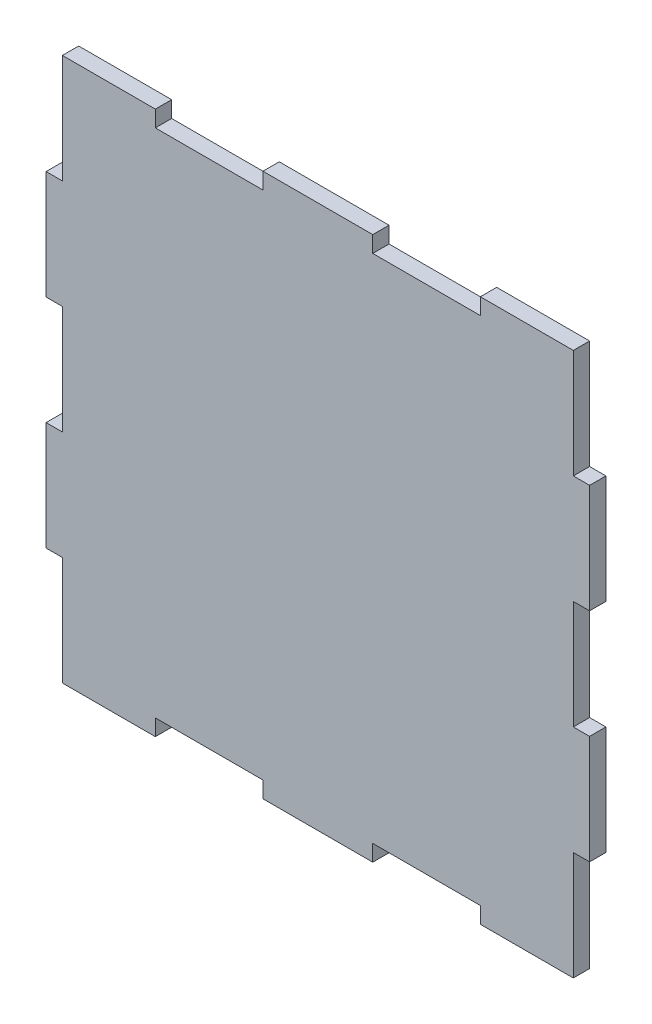
ISO-10303-21;
HEADER;
FILE_DESCRIPTION(('STEP AP214'),'2;1');
FILE_NAME('part.step','',(''),(''),'','','');
FILE_SCHEMA(('AUTOMOTIVE_DESIGN { 1 0 10303 214 1 1 1 1 }'));
ENDSEC;
DATA;
#1=APPLICATION_CONTEXT('core data for automotive mechanical design processes');
#2=APPLICATION_PROTOCOL_DEFINITION('international standard','automotive_design',2000,#1);
#3=PRODUCT_CONTEXT('',#1,'mechanical');
#4=PRODUCT('Part','Part','',(#3));
#5=PRODUCT_RELATED_PRODUCT_CATEGORY('part','',(#4));
#6=PRODUCT_DEFINITION_FORMATION('','',#4);
#7=PRODUCT_DEFINITION_CONTEXT('part definition',#1,'design');
#8=PRODUCT_DEFINITION('design','',#6,#7);
#9=PRODUCT_DEFINITION_SHAPE('','',#8);
#10=(LENGTH_UNIT() NAMED_UNIT(*) SI_UNIT(.MILLI.,.METRE.));
#11=(NAMED_UNIT(*) PLANE_ANGLE_UNIT() SI_UNIT($,.RADIAN.));
#12=(NAMED_UNIT(*) SI_UNIT($,.STERADIAN.) SOLID_ANGLE_UNIT());
#13=UNCERTAINTY_MEASURE_WITH_UNIT(LENGTH_MEASURE(1.E-05),#10,'distance_accuracy_value','');
#14=(GEOMETRIC_REPRESENTATION_CONTEXT(3) GLOBAL_UNCERTAINTY_ASSIGNED_CONTEXT((#13)) GLOBAL_UNIT_ASSIGNED_CONTEXT((#10,
#11,#12)) REPRESENTATION_CONTEXT('',''));
#15=CARTESIAN_POINT('',(0.,0.,0.));
#16=DIRECTION('',(0.,0.,1.));
#17=DIRECTION('',(1.,0.,0.));
#18=AXIS2_PLACEMENT_3D('',#15,#16,#17);
#19=CARTESIAN_POINT('',(97.0000000000007,6.73072708678998E-13,3.));
#20=DIRECTION('',(1.,0.,0.));
#21=DIRECTION('',(0.,1.,0.));
#22=AXIS2_PLACEMENT_3D('',#19,#20,#21);
#23=PLANE('',#22);
#24=DIRECTION('',(0.,-1.,0.));
#25=VECTOR('',#24,1.);
#26=CARTESIAN_POINT('',(97.0000000000007,6.73072708678998E-13,0.));
#27=LINE('',#26,#25);
#28=CARTESIAN_POINT('',(97.,100.,0.));
#29=VERTEX_POINT('',#28);
#30=CARTESIAN_POINT('',(97.0000000000001,80.0000000000002,0.));
#31=VERTEX_POINT('',#30);
#32=EDGE_CURVE('E469',#29,#31,#27,.T.);
#33=ORIENTED_EDGE('',*,*,#32,.F.);
#34=DIRECTION('',(0.,0.,-1.));
#35=VECTOR('',#34,1.);
#36=CARTESIAN_POINT('',(97.,100.,3.));
#37=LINE('',#36,#35);
#38=CARTESIAN_POINT('',(97.,100.,3.));
#39=VERTEX_POINT('',#38);
#40=EDGE_CURVE('E11',#39,#29,#37,.T.);
#41=ORIENTED_EDGE('',*,*,#40,.F.);
#42=DIRECTION('',(0.,-1.,0.));
#43=VECTOR('',#42,1.);
#44=CARTESIAN_POINT('',(97.0000000000007,6.73072708678998E-13,3.));
#45=LINE('',#44,#43);
#46=CARTESIAN_POINT('',(97.0000000000001,80.0000000000002,3.));
#47=VERTEX_POINT('',#46);
#48=EDGE_CURVE('E369',#39,#47,#45,.T.);
#49=ORIENTED_EDGE('',*,*,#48,.T.);
#50=DIRECTION('',(0.,0.,-1.));
#51=VECTOR('',#50,1.);
#52=CARTESIAN_POINT('',(97.0000000000001,80.0000000000002,3.));
#53=LINE('',#52,#51);
#54=EDGE_CURVE('E52',#47,#31,#53,.T.);
#55=ORIENTED_EDGE('',*,*,#54,.T.);
#56=EDGE_LOOP('',(#33,#41,#49,#55));
#57=FACE_BOUND('',#56,.T.);
#58=ADVANCED_FACE('F36',(#57),#23,.T.);
#59=CARTESIAN_POINT('',(0.,100.,3.));
#60=DIRECTION('',(0.,1.,0.));
#61=DIRECTION('',(0.,0.,1.));
#62=AXIS2_PLACEMENT_3D('',#59,#60,#61);
#63=PLANE('',#62);
#64=DIRECTION('',(1.,0.,0.));
#65=VECTOR('',#64,1.);
#66=CARTESIAN_POINT('',(0.,100.,0.));
#67=LINE('',#66,#65);
#68=CARTESIAN_POINT('',(79.9,100.,0.));
#69=VERTEX_POINT('',#68);
#70=EDGE_CURVE('E463',#69,#29,#67,.T.);
#71=ORIENTED_EDGE('',*,*,#70,.F.);
#72=DIRECTION('',(0.,0.,-1.));
#73=VECTOR('',#72,1.);
#74=CARTESIAN_POINT('',(79.9,100.,3.));
#75=LINE('',#74,#73);
#76=CARTESIAN_POINT('',(79.9,100.,3.));
#77=VERTEX_POINT('',#76);
#78=EDGE_CURVE('E44',#77,#69,#75,.T.);
#79=ORIENTED_EDGE('',*,*,#78,.F.);
#80=DIRECTION('',(1.,0.,0.));
#81=VECTOR('',#80,1.);
#82=CARTESIAN_POINT('',(0.,100.,3.));
#83=LINE('',#82,#81);
#84=EDGE_CURVE('E366',#77,#39,#83,.T.);
#85=ORIENTED_EDGE('',*,*,#84,.T.);
#86=ORIENTED_EDGE('',*,*,#40,.T.);
#87=EDGE_LOOP('',(#71,#79,#85,#86));
#88=FACE_BOUND('',#87,.T.);
#89=ADVANCED_FACE('F468',(#88),#63,.T.);
#90=CARTESIAN_POINT('',(79.8999999999996,-3.69611748614788E-13,3.));
#91=DIRECTION('',(1.,0.,0.));
#92=DIRECTION('',(0.,1.,0.));
#93=AXIS2_PLACEMENT_3D('',#90,#91,#92);
#94=PLANE('',#93);
#95=DIRECTION('',(0.,-1.,0.));
#96=VECTOR('',#95,1.);
#97=CARTESIAN_POINT('',(79.8999999999996,-3.69611748614788E-13,0.));
#98=LINE('',#97,#96);
#99=CARTESIAN_POINT('',(79.9,97.,0.));
#100=VERTEX_POINT('',#99);
#101=EDGE_CURVE('E456',#69,#100,#98,.T.);
#102=ORIENTED_EDGE('',*,*,#101,.T.);
#103=DIRECTION('',(0.,0.,-1.));
#104=VECTOR('',#103,1.);
#105=CARTESIAN_POINT('',(79.9,97.,3.));
#106=LINE('',#105,#104);
#107=CARTESIAN_POINT('',(79.9,97.,3.));
#108=VERTEX_POINT('',#107);
#109=EDGE_CURVE('E449',#108,#100,#106,.T.);
#110=ORIENTED_EDGE('',*,*,#109,.F.);
#111=DIRECTION('',(0.,-1.,0.));
#112=VECTOR('',#111,1.);
#113=CARTESIAN_POINT('',(79.8999999999996,-3.69611748614788E-13,3.));
#114=LINE('',#113,#112);
#115=EDGE_CURVE('E364',#77,#108,#114,.T.);
#116=ORIENTED_EDGE('',*,*,#115,.F.);
#117=ORIENTED_EDGE('',*,*,#78,.T.);
#118=EDGE_LOOP('',(#102,#110,#116,#117));
#119=FACE_BOUND('',#118,.T.);
#120=ADVANCED_FACE('F454',(#119),#94,.F.);
#121=CARTESIAN_POINT('',(0.,97.,3.));
#122=DIRECTION('',(0.,1.,0.));
#123=DIRECTION('',(-1.,0.,0.));
#124=AXIS2_PLACEMENT_3D('',#121,#122,#123);
#125=PLANE('',#124);
#126=DIRECTION('',(1.,0.,0.));
#127=VECTOR('',#126,1.);
#128=CARTESIAN_POINT('',(0.,97.,0.));
#129=LINE('',#128,#127);
#130=CARTESIAN_POINT('',(60.1,97.,0.));
#131=VERTEX_POINT('',#130);
#132=EDGE_CURVE('E466',#131,#100,#129,.T.);
#133=ORIENTED_EDGE('',*,*,#132,.F.);
#134=DIRECTION('',(0.,0.,-1.));
#135=VECTOR('',#134,1.);
#136=CARTESIAN_POINT('',(60.1,97.,3.));
#137=LINE('',#136,#135);
#138=CARTESIAN_POINT('',(60.1,97.,3.));
#139=VERTEX_POINT('',#138);
#140=EDGE_CURVE('E447',#139,#131,#137,.T.);
#141=ORIENTED_EDGE('',*,*,#140,.F.);
#142=DIRECTION('',(1.,0.,0.));
#143=VECTOR('',#142,1.);
#144=CARTESIAN_POINT('',(0.,97.,3.));
#145=LINE('',#144,#143);
#146=EDGE_CURVE('E361',#139,#108,#145,.T.);
#147=ORIENTED_EDGE('',*,*,#146,.T.);
#148=ORIENTED_EDGE('',*,*,#109,.T.);
#149=EDGE_LOOP('',(#133,#141,#147,#148));
#150=FACE_BOUND('',#149,.T.);
#151=ADVANCED_FACE('F668',(#150),#125,.T.);
#152=CARTESIAN_POINT('',(60.1,0.,3.));
#153=DIRECTION('',(1.,0.,0.));
#154=DIRECTION('',(0.,0.,-1.));
#155=AXIS2_PLACEMENT_3D('',#152,#153,#154);
#156=PLANE('',#155);
#157=DIRECTION('',(0.,-1.,0.));
#158=VECTOR('',#157,1.);
#159=CARTESIAN_POINT('',(60.1,0.,0.));
#160=LINE('',#159,#158);
#161=CARTESIAN_POINT('',(60.1,100.,0.));
#162=VERTEX_POINT('',#161);
#163=EDGE_CURVE('E479',#162,#131,#160,.T.);
#164=ORIENTED_EDGE('',*,*,#163,.F.);
#165=DIRECTION('',(0.,0.,-1.));
#166=VECTOR('',#165,1.);
#167=CARTESIAN_POINT('',(60.1,100.,3.));
#168=LINE('',#167,#166);
#169=CARTESIAN_POINT('',(60.1,100.,3.));
#170=VERTEX_POINT('',#169);
#171=EDGE_CURVE('E445',#170,#162,#168,.T.);
#172=ORIENTED_EDGE('',*,*,#171,.F.);
#173=DIRECTION('',(0.,-1.,0.));
#174=VECTOR('',#173,1.);
#175=CARTESIAN_POINT('',(60.1,0.,3.));
#176=LINE('',#175,#174);
#177=EDGE_CURVE('E358',#170,#139,#176,.T.);
#178=ORIENTED_EDGE('',*,*,#177,.T.);
#179=ORIENTED_EDGE('',*,*,#140,.T.);
#180=EDGE_LOOP('',(#164,#172,#178,#179));
#181=FACE_BOUND('',#180,.T.);
#182=ADVANCED_FACE('F665',(#181),#156,.T.);
#183=CARTESIAN_POINT('',(39.9,100.,0.));
#184=VERTEX_POINT('',#183);
#185=EDGE_CURVE('E472',#184,#162,#67,.T.);
#186=ORIENTED_EDGE('',*,*,#185,.F.);
#187=DIRECTION('',(0.,0.,-1.));
#188=VECTOR('',#187,1.);
#189=CARTESIAN_POINT('',(39.9,100.,3.));
#190=LINE('',#189,#188);
#191=CARTESIAN_POINT('',(39.9,100.,3.));
#192=VERTEX_POINT('',#191);
#193=EDGE_CURVE('E443',#192,#184,#190,.T.);
#194=ORIENTED_EDGE('',*,*,#193,.F.);
#195=EDGE_CURVE('E357',#192,#170,#83,.T.);
#196=ORIENTED_EDGE('',*,*,#195,.T.);
#197=ORIENTED_EDGE('',*,*,#171,.T.);
#198=EDGE_LOOP('',(#186,#194,#196,#197));
#199=FACE_BOUND('',#198,.T.);
#200=ADVANCED_FACE('F662',(#199),#63,.T.);
#201=CARTESIAN_POINT('',(39.8999999999998,0.,3.));
#202=DIRECTION('',(1.,0.,0.));
#203=DIRECTION('',(0.,1.,0.));
#204=AXIS2_PLACEMENT_3D('',#201,#202,#203);
#205=PLANE('',#204);
#206=DIRECTION('',(0.,-1.,0.));
#207=VECTOR('',#206,1.);
#208=CARTESIAN_POINT('',(39.8999999999998,0.,0.));
#209=LINE('',#208,#207);
#210=CARTESIAN_POINT('',(39.9,97.,0.));
#211=VERTEX_POINT('',#210);
#212=EDGE_CURVE('E478',#184,#211,#209,.T.);
#213=ORIENTED_EDGE('',*,*,#212,.T.);
#214=DIRECTION('',(0.,0.,-1.));
#215=VECTOR('',#214,1.);
#216=CARTESIAN_POINT('',(39.9,97.,3.));
#217=LINE('',#216,#215);
#218=CARTESIAN_POINT('',(39.9,97.,3.));
#219=VERTEX_POINT('',#218);
#220=EDGE_CURVE('E441',#219,#211,#217,.T.);
#221=ORIENTED_EDGE('',*,*,#220,.F.);
#222=DIRECTION('',(0.,-1.,0.));
#223=VECTOR('',#222,1.);
#224=CARTESIAN_POINT('',(39.8999999999998,0.,3.));
#225=LINE('',#224,#223);
#226=EDGE_CURVE('E355',#192,#219,#225,.T.);
#227=ORIENTED_EDGE('',*,*,#226,.F.);
#228=ORIENTED_EDGE('',*,*,#193,.T.);
#229=EDGE_LOOP('',(#213,#221,#227,#228));
#230=FACE_BOUND('',#229,.T.);
#231=ADVANCED_FACE('F658',(#230),#205,.F.);
#232=CARTESIAN_POINT('',(0.,97.,3.));
#233=DIRECTION('',(0.,1.,0.));
#234=DIRECTION('',(-1.,0.,0.));
#235=AXIS2_PLACEMENT_3D('',#232,#233,#234);
#236=PLANE('',#235);
#237=DIRECTION('',(1.,0.,0.));
#238=VECTOR('',#237,1.);
#239=CARTESIAN_POINT('',(0.,97.,0.));
#240=LINE('',#239,#238);
#241=CARTESIAN_POINT('',(20.1,97.,0.));
#242=VERTEX_POINT('',#241);
#243=EDGE_CURVE('E483',#242,#211,#240,.T.);
#244=ORIENTED_EDGE('',*,*,#243,.F.);
#245=DIRECTION('',(0.,0.,-1.));
#246=VECTOR('',#245,1.);
#247=CARTESIAN_POINT('',(20.1,97.,3.));
#248=LINE('',#247,#246);
#249=CARTESIAN_POINT('',(20.1,97.,3.));
#250=VERTEX_POINT('',#249);
#251=EDGE_CURVE('E439',#250,#242,#248,.T.);
#252=ORIENTED_EDGE('',*,*,#251,.F.);
#253=DIRECTION('',(1.,0.,0.));
#254=VECTOR('',#253,1.);
#255=CARTESIAN_POINT('',(0.,97.,3.));
#256=LINE('',#255,#254);
#257=EDGE_CURVE('E352',#250,#219,#256,.T.);
#258=ORIENTED_EDGE('',*,*,#257,.T.);
#259=ORIENTED_EDGE('',*,*,#220,.T.);
#260=EDGE_LOOP('',(#244,#252,#258,#259));
#261=FACE_BOUND('',#260,.T.);
#262=ADVANCED_FACE('F653',(#261),#236,.T.);
#263=CARTESIAN_POINT('',(20.1,0.,3.));
#264=DIRECTION('',(1.,0.,0.));
#265=DIRECTION('',(0.,0.,-1.));
#266=AXIS2_PLACEMENT_3D('',#263,#264,#265);
#267=PLANE('',#266);
#268=DIRECTION('',(0.,-1.,0.));
#269=VECTOR('',#268,1.);
#270=CARTESIAN_POINT('',(20.1,0.,0.));
#271=LINE('',#270,#269);
#272=CARTESIAN_POINT('',(20.1,100.,0.));
#273=VERTEX_POINT('',#272);
#274=EDGE_CURVE('E476',#273,#242,#271,.T.);
#275=ORIENTED_EDGE('',*,*,#274,.F.);
#276=DIRECTION('',(0.,0.,-1.));
#277=VECTOR('',#276,1.);
#278=CARTESIAN_POINT('',(20.1,100.,3.));
#279=LINE('',#278,#277);
#280=CARTESIAN_POINT('',(20.1,100.,3.));
#281=VERTEX_POINT('',#280);
#282=EDGE_CURVE('E437',#281,#273,#279,.T.);
#283=ORIENTED_EDGE('',*,*,#282,.F.);
#284=DIRECTION('',(0.,-1.,0.));
#285=VECTOR('',#284,1.);
#286=CARTESIAN_POINT('',(20.1,0.,3.));
#287=LINE('',#286,#285);
#288=EDGE_CURVE('E349',#281,#250,#287,.T.);
#289=ORIENTED_EDGE('',*,*,#288,.T.);
#290=ORIENTED_EDGE('',*,*,#251,.T.);
#291=EDGE_LOOP('',(#275,#283,#289,#290));
#292=FACE_BOUND('',#291,.T.);
#293=ADVANCED_FACE('F650',(#292),#267,.T.);
#294=CARTESIAN_POINT('',(3.,100.,0.));
#295=VERTEX_POINT('',#294);
#296=EDGE_CURVE('E471',#295,#273,#67,.T.);
#297=ORIENTED_EDGE('',*,*,#296,.F.);
#298=DIRECTION('',(0.,0.,-1.));
#299=VECTOR('',#298,1.);
#300=CARTESIAN_POINT('',(3.,100.,3.));
#301=LINE('',#300,#299);
#302=CARTESIAN_POINT('',(3.,100.,3.));
#303=VERTEX_POINT('',#302);
#304=EDGE_CURVE('E435',#303,#295,#301,.T.);
#305=ORIENTED_EDGE('',*,*,#304,.F.);
#306=EDGE_CURVE('E348',#303,#281,#83,.T.);
#307=ORIENTED_EDGE('',*,*,#306,.T.);
#308=ORIENTED_EDGE('',*,*,#282,.T.);
#309=EDGE_LOOP('',(#297,#305,#307,#308));
#310=FACE_BOUND('',#309,.T.);
#311=ADVANCED_FACE('F645',(#310),#63,.T.);
#312=CARTESIAN_POINT('',(3.00000000000001,0.,3.));
#313=DIRECTION('',(1.,0.,0.));
#314=DIRECTION('',(0.,1.,0.));
#315=AXIS2_PLACEMENT_3D('',#312,#313,#314);
#316=PLANE('',#315);
#317=DIRECTION('',(0.,-1.,0.));
#318=VECTOR('',#317,1.);
#319=CARTESIAN_POINT('',(3.00000000000001,0.,0.));
#320=LINE('',#319,#318);
#321=CARTESIAN_POINT('',(3.,80.,0.));
#322=VERTEX_POINT('',#321);
#323=EDGE_CURVE('E475',#295,#322,#320,.T.);
#324=ORIENTED_EDGE('',*,*,#323,.T.);
#325=DIRECTION('',(0.,0.,-1.));
#326=VECTOR('',#325,1.);
#327=CARTESIAN_POINT('',(3.,80.,3.));
#328=LINE('',#327,#326);
#329=CARTESIAN_POINT('',(3.,80.,3.));
#330=VERTEX_POINT('',#329);
#331=EDGE_CURVE('E432',#330,#322,#328,.T.);
#332=ORIENTED_EDGE('',*,*,#331,.F.);
#333=DIRECTION('',(0.,-1.,0.));
#334=VECTOR('',#333,1.);
#335=CARTESIAN_POINT('',(3.00000000000001,0.,3.));
#336=LINE('',#335,#334);
#337=EDGE_CURVE('E346',#303,#330,#336,.T.);
#338=ORIENTED_EDGE('',*,*,#337,.F.);
#339=ORIENTED_EDGE('',*,*,#304,.T.);
#340=EDGE_LOOP('',(#324,#332,#338,#339));
#341=FACE_BOUND('',#340,.T.);
#342=ADVANCED_FACE('F641',(#341),#316,.F.);
#343=CARTESIAN_POINT('',(0.,80.,3.));
#344=DIRECTION('',(0.,-1.,0.));
#345=DIRECTION('',(0.,0.,-1.));
#346=AXIS2_PLACEMENT_3D('',#343,#344,#345);
#347=PLANE('',#346);
#348=DIRECTION('',(-1.,0.,0.));
#349=VECTOR('',#348,1.);
#350=CARTESIAN_POINT('',(0.,80.,0.));
#351=LINE('',#350,#349);
#352=CARTESIAN_POINT('',(0.,80.,0.));
#353=VERTEX_POINT('',#352);
#354=EDGE_CURVE('E494',#322,#353,#351,.T.);
#355=ORIENTED_EDGE('',*,*,#354,.T.);
#356=DIRECTION('',(0.,0.,-1.));
#357=VECTOR('',#356,1.);
#358=CARTESIAN_POINT('',(0.,80.,3.));
#359=LINE('',#358,#357);
#360=CARTESIAN_POINT('',(0.,80.,3.));
#361=VERTEX_POINT('',#360);
#362=EDGE_CURVE('E430',#361,#353,#359,.T.);
#363=ORIENTED_EDGE('',*,*,#362,.F.);
#364=DIRECTION('',(-1.,0.,0.));
#365=VECTOR('',#364,1.);
#366=CARTESIAN_POINT('',(0.,80.,3.));
#367=LINE('',#366,#365);
#368=EDGE_CURVE('E344',#330,#361,#367,.T.);
#369=ORIENTED_EDGE('',*,*,#368,.F.);
#370=ORIENTED_EDGE('',*,*,#331,.T.);
#371=EDGE_LOOP('',(#355,#363,#369,#370));
#372=FACE_BOUND('',#371,.T.);
#373=ADVANCED_FACE('F637',(#372),#347,.F.);
#374=CARTESIAN_POINT('',(0.,0.,3.));
#375=DIRECTION('',(-1.,0.,0.));
#376=DIRECTION('',(0.,0.,1.));
#377=AXIS2_PLACEMENT_3D('',#374,#375,#376);
#378=PLANE('',#377);
#379=DIRECTION('',(0.,1.,0.));
#380=VECTOR('',#379,1.);
#381=CARTESIAN_POINT('',(0.,0.,0.));
#382=LINE('',#381,#380);
#383=CARTESIAN_POINT('',(0.,60.,0.));
#384=VERTEX_POINT('',#383);
#385=EDGE_CURVE('E497',#384,#353,#382,.T.);
#386=ORIENTED_EDGE('',*,*,#385,.F.);
#387=DIRECTION('',(0.,0.,-1.));
#388=VECTOR('',#387,1.);
#389=CARTESIAN_POINT('',(0.,60.,3.));
#390=LINE('',#389,#388);
#391=CARTESIAN_POINT('',(0.,60.,3.));
#392=VERTEX_POINT('',#391);
#393=EDGE_CURVE('E428',#392,#384,#390,.T.);
#394=ORIENTED_EDGE('',*,*,#393,.F.);
#395=DIRECTION('',(0.,1.,0.));
#396=VECTOR('',#395,1.);
#397=CARTESIAN_POINT('',(0.,0.,3.));
#398=LINE('',#397,#396);
#399=EDGE_CURVE('E341',#392,#361,#398,.T.);
#400=ORIENTED_EDGE('',*,*,#399,.T.);
#401=ORIENTED_EDGE('',*,*,#362,.T.);
#402=EDGE_LOOP('',(#386,#394,#400,#401));
#403=FACE_BOUND('',#402,.T.);
#404=ADVANCED_FACE('F632',(#403),#378,.T.);
#405=CARTESIAN_POINT('',(0.,60.,3.));
#406=DIRECTION('',(0.,-1.,0.));
#407=DIRECTION('',(0.,0.,-1.));
#408=AXIS2_PLACEMENT_3D('',#405,#406,#407);
#409=PLANE('',#408);
#410=DIRECTION('',(-1.,0.,0.));
#411=VECTOR('',#410,1.);
#412=CARTESIAN_POINT('',(0.,60.,0.));
#413=LINE('',#412,#411);
#414=CARTESIAN_POINT('',(3.00000000000042,60.,0.));
#415=VERTEX_POINT('',#414);
#416=EDGE_CURVE('E500',#415,#384,#413,.T.);
#417=ORIENTED_EDGE('',*,*,#416,.F.);
#418=DIRECTION('',(0.,0.,-1.));
#419=VECTOR('',#418,1.);
#420=CARTESIAN_POINT('',(3.00000000000042,60.,3.));
#421=LINE('',#420,#419);
#422=CARTESIAN_POINT('',(3.00000000000042,60.,3.));
#423=VERTEX_POINT('',#422);
#424=EDGE_CURVE('E426',#423,#415,#421,.T.);
#425=ORIENTED_EDGE('',*,*,#424,.F.);
#426=DIRECTION('',(-1.,0.,0.));
#427=VECTOR('',#426,1.);
#428=CARTESIAN_POINT('',(0.,60.,3.));
#429=LINE('',#428,#427);
#430=EDGE_CURVE('E338',#423,#392,#429,.T.);
#431=ORIENTED_EDGE('',*,*,#430,.T.);
#432=ORIENTED_EDGE('',*,*,#393,.T.);
#433=EDGE_LOOP('',(#417,#425,#431,#432));
#434=FACE_BOUND('',#433,.T.);
#435=ADVANCED_FACE('F627',(#434),#409,.T.);
#436=CARTESIAN_POINT('',(3.00000000000043,0.,3.));
#437=DIRECTION('',(1.,0.,0.));
#438=DIRECTION('',(0.,1.,0.));
#439=AXIS2_PLACEMENT_3D('',#436,#437,#438);
#440=PLANE('',#439);
#441=DIRECTION('',(0.,-1.,0.));
#442=VECTOR('',#441,1.);
#443=CARTESIAN_POINT('',(3.00000000000043,0.,0.));
#444=LINE('',#443,#442);
#445=CARTESIAN_POINT('',(3.00000000000042,40.,0.));
#446=VERTEX_POINT('',#445);
#447=EDGE_CURVE('E504',#415,#446,#444,.T.);
#448=ORIENTED_EDGE('',*,*,#447,.T.);
#449=DIRECTION('',(0.,0.,-1.));
#450=VECTOR('',#449,1.);
#451=CARTESIAN_POINT('',(3.00000000000042,40.,3.));
#452=LINE('',#451,#450);
#453=CARTESIAN_POINT('',(3.00000000000042,40.,3.));
#454=VERTEX_POINT('',#453);
#455=EDGE_CURVE('E423',#454,#446,#452,.T.);
#456=ORIENTED_EDGE('',*,*,#455,.F.);
#457=DIRECTION('',(0.,-1.,0.));
#458=VECTOR('',#457,1.);
#459=CARTESIAN_POINT('',(3.00000000000043,0.,3.));
#460=LINE('',#459,#458);
#461=EDGE_CURVE('E336',#423,#454,#460,.T.);
#462=ORIENTED_EDGE('',*,*,#461,.F.);
#463=ORIENTED_EDGE('',*,*,#424,.T.);
#464=EDGE_LOOP('',(#448,#456,#462,#463));
#465=FACE_BOUND('',#464,.T.);
#466=ADVANCED_FACE('F624',(#465),#440,.F.);
#467=CARTESIAN_POINT('',(0.,40.,3.));
#468=DIRECTION('',(0.,-1.,0.));
#469=DIRECTION('',(0.,0.,-1.));
#470=AXIS2_PLACEMENT_3D('',#467,#468,#469);
#471=PLANE('',#470);
#472=DIRECTION('',(-1.,0.,0.));
#473=VECTOR('',#472,1.);
#474=CARTESIAN_POINT('',(0.,40.,0.));
#475=LINE('',#474,#473);
#476=CARTESIAN_POINT('',(0.,40.,0.));
#477=VERTEX_POINT('',#476);
#478=EDGE_CURVE('E506',#446,#477,#475,.T.);
#479=ORIENTED_EDGE('',*,*,#478,.T.);
#480=DIRECTION('',(0.,0.,-1.));
#481=VECTOR('',#480,1.);
#482=CARTESIAN_POINT('',(0.,40.,3.));
#483=LINE('',#482,#481);
#484=CARTESIAN_POINT('',(0.,40.,3.));
#485=VERTEX_POINT('',#484);
#486=EDGE_CURVE('E421',#485,#477,#483,.T.);
#487=ORIENTED_EDGE('',*,*,#486,.F.);
#488=DIRECTION('',(-1.,0.,0.));
#489=VECTOR('',#488,1.);
#490=CARTESIAN_POINT('',(0.,40.,3.));
#491=LINE('',#490,#489);
#492=EDGE_CURVE('E334',#454,#485,#491,.T.);
#493=ORIENTED_EDGE('',*,*,#492,.F.);
#494=ORIENTED_EDGE('',*,*,#455,.T.);
#495=EDGE_LOOP('',(#479,#487,#493,#494));
#496=FACE_BOUND('',#495,.T.);
#497=ADVANCED_FACE('F619',(#496),#471,.F.);
#498=CARTESIAN_POINT('',(0.,20.,0.));
#499=VERTEX_POINT('',#498);
#500=EDGE_CURVE('E501',#499,#477,#382,.T.);
#501=ORIENTED_EDGE('',*,*,#500,.F.);
#502=DIRECTION('',(0.,0.,-1.));
#503=VECTOR('',#502,1.);
#504=CARTESIAN_POINT('',(0.,20.,3.));
#505=LINE('',#504,#503);
#506=CARTESIAN_POINT('',(0.,20.,3.));
#507=VERTEX_POINT('',#506);
#508=EDGE_CURVE('E419',#507,#499,#505,.T.);
#509=ORIENTED_EDGE('',*,*,#508,.F.);
#510=EDGE_CURVE('E333',#507,#485,#398,.T.);
#511=ORIENTED_EDGE('',*,*,#510,.T.);
#512=ORIENTED_EDGE('',*,*,#486,.T.);
#513=EDGE_LOOP('',(#501,#509,#511,#512));
#514=FACE_BOUND('',#513,.T.);
#515=ADVANCED_FACE('F613',(#514),#378,.T.);
#516=CARTESIAN_POINT('',(0.,20.,3.));
#517=DIRECTION('',(0.,-1.,0.));
#518=DIRECTION('',(0.,0.,-1.));
#519=AXIS2_PLACEMENT_3D('',#516,#517,#518);
#520=PLANE('',#519);
#521=DIRECTION('',(-1.,0.,0.));
#522=VECTOR('',#521,1.);
#523=CARTESIAN_POINT('',(0.,20.,0.));
#524=LINE('',#523,#522);
#525=CARTESIAN_POINT('',(3.00000000000084,20.,0.));
#526=VERTEX_POINT('',#525);
#527=EDGE_CURVE('E509',#526,#499,#524,.T.);
#528=ORIENTED_EDGE('',*,*,#527,.F.);
#529=DIRECTION('',(0.,0.,-1.));
#530=VECTOR('',#529,1.);
#531=CARTESIAN_POINT('',(3.00000000000084,20.,3.));
#532=LINE('',#531,#530);
#533=CARTESIAN_POINT('',(3.00000000000084,20.,3.));
#534=VERTEX_POINT('',#533);
#535=EDGE_CURVE('E417',#534,#526,#532,.T.);
#536=ORIENTED_EDGE('',*,*,#535,.F.);
#537=DIRECTION('',(-1.,0.,0.));
#538=VECTOR('',#537,1.);
#539=CARTESIAN_POINT('',(0.,20.,3.));
#540=LINE('',#539,#538);
#541=EDGE_CURVE('E330',#534,#507,#540,.T.);
#542=ORIENTED_EDGE('',*,*,#541,.T.);
#543=ORIENTED_EDGE('',*,*,#508,.T.);
#544=EDGE_LOOP('',(#528,#536,#542,#543));
#545=FACE_BOUND('',#544,.T.);
#546=ADVANCED_FACE('F606',(#545),#520,.T.);
#547=CARTESIAN_POINT('',(3.00000000000084,0.,3.));
#548=DIRECTION('',(1.,0.,0.));
#549=DIRECTION('',(0.,1.,0.));
#550=AXIS2_PLACEMENT_3D('',#547,#548,#549);
#551=PLANE('',#550);
#552=DIRECTION('',(0.,-1.,0.));
#553=VECTOR('',#552,1.);
#554=CARTESIAN_POINT('',(3.00000000000084,0.,0.));
#555=LINE('',#554,#553);
#556=CARTESIAN_POINT('',(3.00000000000084,0.,0.));
#557=VERTEX_POINT('',#556);
#558=EDGE_CURVE('E512',#526,#557,#555,.T.);
#559=ORIENTED_EDGE('',*,*,#558,.T.);
#560=DIRECTION('',(0.,0.,-1.));
#561=VECTOR('',#560,1.);
#562=CARTESIAN_POINT('',(3.00000000000084,0.,3.));
#563=LINE('',#562,#561);
#564=CARTESIAN_POINT('',(3.00000000000084,0.,3.));
#565=VERTEX_POINT('',#564);
#566=EDGE_CURVE('E414',#565,#557,#563,.T.);
#567=ORIENTED_EDGE('',*,*,#566,.F.);
#568=DIRECTION('',(0.,-1.,0.));
#569=VECTOR('',#568,1.);
#570=CARTESIAN_POINT('',(3.00000000000084,0.,3.));
#571=LINE('',#570,#569);
#572=EDGE_CURVE('E328',#534,#565,#571,.T.);
#573=ORIENTED_EDGE('',*,*,#572,.F.);
#574=ORIENTED_EDGE('',*,*,#535,.T.);
#575=EDGE_LOOP('',(#559,#567,#573,#574));
#576=FACE_BOUND('',#575,.T.);
#577=ADVANCED_FACE('F795',(#576),#551,.F.);
#578=CARTESIAN_POINT('',(0.,0.,3.));
#579=DIRECTION('',(0.,1.,0.));
#580=DIRECTION('',(0.,0.,1.));
#581=AXIS2_PLACEMENT_3D('',#578,#579,#580);
#582=PLANE('',#581);
#583=DIRECTION('',(1.,0.,0.));
#584=VECTOR('',#583,1.);
#585=CARTESIAN_POINT('',(0.,0.,0.));
#586=LINE('',#585,#584);
#587=CARTESIAN_POINT('',(20.1,0.,0.));
#588=VERTEX_POINT('',#587);
#589=EDGE_CURVE('E514',#557,#588,#586,.T.);
#590=ORIENTED_EDGE('',*,*,#589,.T.);
#591=DIRECTION('',(0.,0.,-1.));
#592=VECTOR('',#591,1.);
#593=CARTESIAN_POINT('',(20.1,0.,3.));
#594=LINE('',#593,#592);
#595=CARTESIAN_POINT('',(20.1,0.,3.));
#596=VERTEX_POINT('',#595);
#597=EDGE_CURVE('E411',#596,#588,#594,.T.);
#598=ORIENTED_EDGE('',*,*,#597,.F.);
#599=DIRECTION('',(1.,0.,0.));
#600=VECTOR('',#599,1.);
#601=CARTESIAN_POINT('',(0.,0.,3.));
#602=LINE('',#601,#600);
#603=EDGE_CURVE('E326',#565,#596,#602,.T.);
#604=ORIENTED_EDGE('',*,*,#603,.F.);
#605=ORIENTED_EDGE('',*,*,#566,.T.);
#606=EDGE_LOOP('',(#590,#598,#604,#605));
#607=FACE_BOUND('',#606,.T.);
#608=ADVANCED_FACE('F599',(#607),#582,.F.);
#609=CARTESIAN_POINT('',(20.1,0.,3.));
#610=DIRECTION('',(-1.,0.,0.));
#611=DIRECTION('',(0.,0.,1.));
#612=AXIS2_PLACEMENT_3D('',#609,#610,#611);
#613=PLANE('',#612);
#614=DIRECTION('',(0.,1.,0.));
#615=VECTOR('',#614,1.);
#616=CARTESIAN_POINT('',(20.1,0.,0.));
#617=LINE('',#616,#615);
#618=CARTESIAN_POINT('',(20.1,3.,0.));
#619=VERTEX_POINT('',#618);
#620=EDGE_CURVE('E516',#588,#619,#617,.T.);
#621=ORIENTED_EDGE('',*,*,#620,.T.);
#622=DIRECTION('',(0.,0.,-1.));
#623=VECTOR('',#622,1.);
#624=CARTESIAN_POINT('',(20.1,3.,3.));
#625=LINE('',#624,#623);
#626=CARTESIAN_POINT('',(20.1,3.,3.));
#627=VERTEX_POINT('',#626);
#628=EDGE_CURVE('E408',#627,#619,#625,.T.);
#629=ORIENTED_EDGE('',*,*,#628,.F.);
#630=DIRECTION('',(0.,1.,0.));
#631=VECTOR('',#630,1.);
#632=CARTESIAN_POINT('',(20.1,0.,3.));
#633=LINE('',#632,#631);
#634=EDGE_CURVE('E324',#596,#627,#633,.T.);
#635=ORIENTED_EDGE('',*,*,#634,.F.);
#636=ORIENTED_EDGE('',*,*,#597,.T.);
#637=EDGE_LOOP('',(#621,#629,#635,#636));
#638=FACE_BOUND('',#637,.T.);
#639=ADVANCED_FACE('F595',(#638),#613,.F.);
#640=CARTESIAN_POINT('',(0.,2.99999999999999,3.));
#641=DIRECTION('',(0.,1.,0.));
#642=DIRECTION('',(-1.,0.,0.));
#643=AXIS2_PLACEMENT_3D('',#640,#641,#642);
#644=PLANE('',#643);
#645=DIRECTION('',(1.,0.,0.));
#646=VECTOR('',#645,1.);
#647=CARTESIAN_POINT('',(0.,2.99999999999999,0.));
#648=LINE('',#647,#646);
#649=CARTESIAN_POINT('',(39.9,3.00000000000002,0.));
#650=VERTEX_POINT('',#649);
#651=EDGE_CURVE('E520',#619,#650,#648,.T.);
#652=ORIENTED_EDGE('',*,*,#651,.T.);
#653=DIRECTION('',(0.,0.,-1.));
#654=VECTOR('',#653,1.);
#655=CARTESIAN_POINT('',(39.9,3.00000000000002,3.));
#656=LINE('',#655,#654);
#657=CARTESIAN_POINT('',(39.9,3.00000000000002,3.));
#658=VERTEX_POINT('',#657);
#659=EDGE_CURVE('E406',#658,#650,#656,.T.);
#660=ORIENTED_EDGE('',*,*,#659,.F.);
#661=DIRECTION('',(1.,0.,0.));
#662=VECTOR('',#661,1.);
#663=CARTESIAN_POINT('',(0.,2.99999999999999,3.));
#664=LINE('',#663,#662);
#665=EDGE_CURVE('E322',#627,#658,#664,.T.);
#666=ORIENTED_EDGE('',*,*,#665,.F.);
#667=ORIENTED_EDGE('',*,*,#628,.T.);
#668=EDGE_LOOP('',(#652,#660,#666,#667));
#669=FACE_BOUND('',#668,.T.);
#670=ADVANCED_FACE('F591',(#669),#644,.F.);
#671=CARTESIAN_POINT('',(39.9,0.,3.));
#672=DIRECTION('',(-1.,0.,0.));
#673=DIRECTION('',(0.,-1.,0.));
#674=AXIS2_PLACEMENT_3D('',#671,#672,#673);
#675=PLANE('',#674);
#676=DIRECTION('',(0.,1.,0.));
#677=VECTOR('',#676,1.);
#678=CARTESIAN_POINT('',(39.9,0.,0.));
#679=LINE('',#678,#677);
#680=CARTESIAN_POINT('',(39.9,0.,0.));
#681=VERTEX_POINT('',#680);
#682=EDGE_CURVE('E523',#681,#650,#679,.T.);
#683=ORIENTED_EDGE('',*,*,#682,.F.);
#684=DIRECTION('',(0.,0.,-1.));
#685=VECTOR('',#684,1.);
#686=CARTESIAN_POINT('',(39.9,0.,3.));
#687=LINE('',#686,#685);
#688=CARTESIAN_POINT('',(39.9,0.,3.));
#689=VERTEX_POINT('',#688);
#690=EDGE_CURVE('E404',#689,#681,#687,.T.);
#691=ORIENTED_EDGE('',*,*,#690,.F.);
#692=DIRECTION('',(0.,1.,0.));
#693=VECTOR('',#692,1.);
#694=CARTESIAN_POINT('',(39.9,0.,3.));
#695=LINE('',#694,#693);
#696=EDGE_CURVE('E319',#689,#658,#695,.T.);
#697=ORIENTED_EDGE('',*,*,#696,.T.);
#698=ORIENTED_EDGE('',*,*,#659,.T.);
#699=EDGE_LOOP('',(#683,#691,#697,#698));
#700=FACE_BOUND('',#699,.T.);
#701=ADVANCED_FACE('F586',(#700),#675,.T.);
#702=CARTESIAN_POINT('',(60.1,0.,0.));
#703=VERTEX_POINT('',#702);
#704=EDGE_CURVE('E518',#681,#703,#586,.T.);
#705=ORIENTED_EDGE('',*,*,#704,.T.);
#706=DIRECTION('',(0.,0.,-1.));
#707=VECTOR('',#706,1.);
#708=CARTESIAN_POINT('',(60.1,0.,3.));
#709=LINE('',#708,#707);
#710=CARTESIAN_POINT('',(60.1,0.,3.));
#711=VERTEX_POINT('',#710);
#712=EDGE_CURVE('E401',#711,#703,#709,.T.);
#713=ORIENTED_EDGE('',*,*,#712,.F.);
#714=EDGE_CURVE('E318',#689,#711,#602,.T.);
#715=ORIENTED_EDGE('',*,*,#714,.F.);
#716=ORIENTED_EDGE('',*,*,#690,.T.);
#717=EDGE_LOOP('',(#705,#713,#715,#716));
#718=FACE_BOUND('',#717,.T.);
#719=ADVANCED_FACE('F568',(#718),#582,.F.);
#720=CARTESIAN_POINT('',(60.1,0.,3.));
#721=DIRECTION('',(-1.,0.,0.));
#722=DIRECTION('',(0.,0.,1.));
#723=AXIS2_PLACEMENT_3D('',#720,#721,#722);
#724=PLANE('',#723);
#725=DIRECTION('',(0.,1.,0.));
#726=VECTOR('',#725,1.);
#727=CARTESIAN_POINT('',(60.1,0.,0.));
#728=LINE('',#727,#726);
#729=CARTESIAN_POINT('',(60.1,3.,0.));
#730=VERTEX_POINT('',#729);
#731=EDGE_CURVE('E526',#703,#730,#728,.T.);
#732=ORIENTED_EDGE('',*,*,#731,.T.);
#733=DIRECTION('',(0.,0.,-1.));
#734=VECTOR('',#733,1.);
#735=CARTESIAN_POINT('',(60.1,3.,3.));
#736=LINE('',#735,#734);
#737=CARTESIAN_POINT('',(60.1,3.,3.));
#738=VERTEX_POINT('',#737);
#739=EDGE_CURVE('E398',#738,#730,#736,.T.);
#740=ORIENTED_EDGE('',*,*,#739,.F.);
#741=DIRECTION('',(0.,1.,0.));
#742=VECTOR('',#741,1.);
#743=CARTESIAN_POINT('',(60.1,0.,3.));
#744=LINE('',#743,#742);
#745=EDGE_CURVE('E316',#711,#738,#744,.T.);
#746=ORIENTED_EDGE('',*,*,#745,.F.);
#747=ORIENTED_EDGE('',*,*,#712,.T.);
#748=EDGE_LOOP('',(#732,#740,#746,#747));
#749=FACE_BOUND('',#748,.T.);
#750=ADVANCED_FACE('F574',(#749),#724,.F.);
#751=CARTESIAN_POINT('',(0.,2.99999999999996,3.));
#752=DIRECTION('',(0.,1.,0.));
#753=DIRECTION('',(-1.,0.,0.));
#754=AXIS2_PLACEMENT_3D('',#751,#752,#753);
#755=PLANE('',#754);
#756=DIRECTION('',(1.,0.,0.));
#757=VECTOR('',#756,1.);
#758=CARTESIAN_POINT('',(0.,2.99999999999996,0.));
#759=LINE('',#758,#757);
#760=CARTESIAN_POINT('',(79.9,3.00000000000002,0.));
#761=VERTEX_POINT('',#760);
#762=EDGE_CURVE('E528',#730,#761,#759,.T.);
#763=ORIENTED_EDGE('',*,*,#762,.T.);
#764=DIRECTION('',(0.,0.,-1.));
#765=VECTOR('',#764,1.);
#766=CARTESIAN_POINT('',(79.9,3.00000000000002,3.));
#767=LINE('',#766,#765);
#768=CARTESIAN_POINT('',(79.9,3.00000000000002,3.));
#769=VERTEX_POINT('',#768);
#770=EDGE_CURVE('E396',#769,#761,#767,.T.);
#771=ORIENTED_EDGE('',*,*,#770,.F.);
#772=DIRECTION('',(1.,0.,0.));
#773=VECTOR('',#772,1.);
#774=CARTESIAN_POINT('',(0.,2.99999999999996,3.));
#775=LINE('',#774,#773);
#776=EDGE_CURVE('E314',#738,#769,#775,.T.);
#777=ORIENTED_EDGE('',*,*,#776,.F.);
#778=ORIENTED_EDGE('',*,*,#739,.T.);
#779=EDGE_LOOP('',(#763,#771,#777,#778));
#780=FACE_BOUND('',#779,.T.);
#781=ADVANCED_FACE('F579',(#780),#755,.F.);
#782=CARTESIAN_POINT('',(79.9,3.6961174861479E-13,3.));
#783=DIRECTION('',(-1.,0.,0.));
#784=DIRECTION('',(0.,-1.,0.));
#785=AXIS2_PLACEMENT_3D('',#782,#783,#784);
#786=PLANE('',#785);
#787=DIRECTION('',(0.,1.,0.));
#788=VECTOR('',#787,1.);
#789=CARTESIAN_POINT('',(79.9,3.6961174861479E-13,0.));
#790=LINE('',#789,#788);
#791=CARTESIAN_POINT('',(79.9,0.,0.));
#792=VERTEX_POINT('',#791);
#793=EDGE_CURVE('E531',#792,#761,#790,.T.);
#794=ORIENTED_EDGE('',*,*,#793,.F.);
#795=DIRECTION('',(0.,0.,-1.));
#796=VECTOR('',#795,1.);
#797=CARTESIAN_POINT('',(79.9,0.,3.));
#798=LINE('',#797,#796);
#799=CARTESIAN_POINT('',(79.9,0.,3.));
#800=VERTEX_POINT('',#799);
#801=EDGE_CURVE('E394',#800,#792,#798,.T.);
#802=ORIENTED_EDGE('',*,*,#801,.F.);
#803=DIRECTION('',(0.,1.,0.));
#804=VECTOR('',#803,1.);
#805=CARTESIAN_POINT('',(79.9,3.6961174861479E-13,3.));
#806=LINE('',#805,#804);
#807=EDGE_CURVE('E311',#800,#769,#806,.T.);
#808=ORIENTED_EDGE('',*,*,#807,.T.);
#809=ORIENTED_EDGE('',*,*,#770,.T.);
#810=EDGE_LOOP('',(#794,#802,#808,#809));
#811=FACE_BOUND('',#810,.T.);
#812=ADVANCED_FACE('F859',(#811),#786,.T.);
#813=CARTESIAN_POINT('',(96.9999999999998,0.,0.));
#814=VERTEX_POINT('',#813);
#815=EDGE_CURVE('E517',#792,#814,#586,.T.);
#816=ORIENTED_EDGE('',*,*,#815,.T.);
#817=DIRECTION('',(0.,0.,-1.));
#818=VECTOR('',#817,1.);
#819=CARTESIAN_POINT('',(96.9999999999998,0.,3.));
#820=LINE('',#819,#818);
#821=CARTESIAN_POINT('',(96.9999999999998,0.,3.));
#822=VERTEX_POINT('',#821);
#823=EDGE_CURVE('E392',#822,#814,#820,.T.);
#824=ORIENTED_EDGE('',*,*,#823,.F.);
#825=EDGE_CURVE('E308',#800,#822,#602,.T.);
#826=ORIENTED_EDGE('',*,*,#825,.F.);
#827=ORIENTED_EDGE('',*,*,#801,.T.);
#828=EDGE_LOOP('',(#816,#824,#826,#827));
#829=FACE_BOUND('',#828,.T.);
#830=ADVANCED_FACE('F563',(#829),#582,.F.);
#831=CARTESIAN_POINT('',(96.9999999999998,6.057654378111E-13,3.));
#832=DIRECTION('',(1.,0.,0.));
#833=DIRECTION('',(0.,1.,0.));
#834=AXIS2_PLACEMENT_3D('',#831,#832,#833);
#835=PLANE('',#834);
#836=DIRECTION('',(0.,-1.,0.));
#837=VECTOR('',#836,1.);
#838=CARTESIAN_POINT('',(96.9999999999998,6.057654378111E-13,0.));
#839=LINE('',#838,#837);
#840=CARTESIAN_POINT('',(96.9999999999997,20.0000000000002,0.));
#841=VERTEX_POINT('',#840);
#842=EDGE_CURVE('E534',#841,#814,#839,.T.);
#843=ORIENTED_EDGE('',*,*,#842,.F.);
#844=DIRECTION('',(0.,0.,-1.));
#845=VECTOR('',#844,1.);
#846=CARTESIAN_POINT('',(96.9999999999997,20.0000000000002,3.));
#847=LINE('',#846,#845);
#848=CARTESIAN_POINT('',(96.9999999999997,20.0000000000002,3.));
#849=VERTEX_POINT('',#848);
#850=EDGE_CURVE('E390',#849,#841,#847,.T.);
#851=ORIENTED_EDGE('',*,*,#850,.F.);
#852=DIRECTION('',(0.,-1.,0.));
#853=VECTOR('',#852,1.);
#854=CARTESIAN_POINT('',(96.9999999999998,6.057654378111E-13,3.));
#855=LINE('',#854,#853);
#856=EDGE_CURVE('E303',#849,#822,#855,.T.);
#857=ORIENTED_EDGE('',*,*,#856,.T.);
#858=ORIENTED_EDGE('',*,*,#823,.T.);
#859=EDGE_LOOP('',(#843,#851,#857,#858));
#860=FACE_BOUND('',#859,.T.);
#861=ADVANCED_FACE('F558',(#860),#835,.T.);
#862=CARTESIAN_POINT('',(-1.48029736616637E-12,19.999999999993,3.));
#863=DIRECTION('',(0.,1.,0.));
#864=DIRECTION('',(-1.,0.,0.));
#865=AXIS2_PLACEMENT_3D('',#862,#863,#864);
#866=PLANE('',#865);
#867=DIRECTION('',(1.,0.,0.));
#868=VECTOR('',#867,1.);
#869=CARTESIAN_POINT('',(-1.48029736616637E-12,19.999999999993,0.));
#870=LINE('',#869,#868);
#871=CARTESIAN_POINT('',(100.,20.0000000000003,0.));
#872=VERTEX_POINT('',#871);
#873=EDGE_CURVE('E537',#841,#872,#870,.T.);
#874=ORIENTED_EDGE('',*,*,#873,.T.);
#875=DIRECTION('',(0.,0.,-1.));
#876=VECTOR('',#875,1.);
#877=CARTESIAN_POINT('',(100.,20.0000000000003,3.));
#878=LINE('',#877,#876);
#879=CARTESIAN_POINT('',(100.,20.0000000000003,3.));
#880=VERTEX_POINT('',#879);
#881=EDGE_CURVE('E387',#880,#872,#878,.T.);
#882=ORIENTED_EDGE('',*,*,#881,.F.);
#883=DIRECTION('',(1.,0.,0.));
#884=VECTOR('',#883,1.);
#885=CARTESIAN_POINT('',(-1.48029736616637E-12,19.999999999993,3.));
#886=LINE('',#885,#884);
#887=EDGE_CURVE('E299',#849,#880,#886,.T.);
#888=ORIENTED_EDGE('',*,*,#887,.F.);
#889=ORIENTED_EDGE('',*,*,#850,.T.);
#890=EDGE_LOOP('',(#874,#882,#888,#889));
#891=FACE_BOUND('',#890,.T.);
#892=ADVANCED_FACE('F884',(#891),#866,.F.);
#893=CARTESIAN_POINT('',(100.,0.,3.));
#894=DIRECTION('',(-1.,0.,0.));
#895=DIRECTION('',(0.,0.,1.));
#896=AXIS2_PLACEMENT_3D('',#893,#894,#895);
#897=PLANE('',#896);
#898=DIRECTION('',(0.,1.,0.));
#899=VECTOR('',#898,1.);
#900=CARTESIAN_POINT('',(100.,0.,0.));
#901=LINE('',#900,#899);
#902=CARTESIAN_POINT('',(100.,40.0000000000004,0.));
#903=VERTEX_POINT('',#902);
#904=EDGE_CURVE('E376',#872,#903,#901,.T.);
#905=ORIENTED_EDGE('',*,*,#904,.T.);
#906=DIRECTION('',(0.,0.,-1.));
#907=VECTOR('',#906,1.);
#908=CARTESIAN_POINT('',(100.,40.0000000000004,3.));
#909=LINE('',#908,#907);
#910=CARTESIAN_POINT('',(100.,40.0000000000004,3.));
#911=VERTEX_POINT('',#910);
#912=EDGE_CURVE('E385',#911,#903,#909,.T.);
#913=ORIENTED_EDGE('',*,*,#912,.F.);
#914=DIRECTION('',(0.,1.,0.));
#915=VECTOR('',#914,1.);
#916=CARTESIAN_POINT('',(100.,0.,3.));
#917=LINE('',#916,#915);
#918=EDGE_CURVE('E294',#880,#911,#917,.T.);
#919=ORIENTED_EDGE('',*,*,#918,.F.);
#920=ORIENTED_EDGE('',*,*,#881,.T.);
#921=EDGE_LOOP('',(#905,#913,#919,#920));
#922=FACE_BOUND('',#921,.T.);
#923=ADVANCED_FACE('F552',(#922),#897,.F.);
#924=CARTESIAN_POINT('',(-2.96059473233325E-12,39.999999999993,3.));
#925=DIRECTION('',(0.,1.,0.));
#926=DIRECTION('',(-1.,0.,0.));
#927=AXIS2_PLACEMENT_3D('',#924,#925,#926);
#928=PLANE('',#927);
#929=DIRECTION('',(1.,0.,0.));
#930=VECTOR('',#929,1.);
#931=CARTESIAN_POINT('',(-2.96059473233325E-12,39.999999999993,0.));
#932=LINE('',#931,#930);
#933=CARTESIAN_POINT('',(97.,40.0000000000002,0.));
#934=VERTEX_POINT('',#933);
#935=EDGE_CURVE('E540',#934,#903,#932,.T.);
#936=ORIENTED_EDGE('',*,*,#935,.F.);
#937=DIRECTION('',(0.,0.,-1.));
#938=VECTOR('',#937,1.);
#939=CARTESIAN_POINT('',(97.,40.0000000000002,3.));
#940=LINE('',#939,#938);
#941=CARTESIAN_POINT('',(97.,40.0000000000002,3.));
#942=VERTEX_POINT('',#941);
#943=EDGE_CURVE('E383',#942,#934,#940,.T.);
#944=ORIENTED_EDGE('',*,*,#943,.F.);
#945=DIRECTION('',(1.,0.,0.));
#946=VECTOR('',#945,1.);
#947=CARTESIAN_POINT('',(-2.96059473233325E-12,39.999999999993,3.));
#948=LINE('',#947,#946);
#949=EDGE_CURVE('E298',#942,#911,#948,.T.);
#950=ORIENTED_EDGE('',*,*,#949,.T.);
#951=ORIENTED_EDGE('',*,*,#912,.T.);
#952=EDGE_LOOP('',(#936,#944,#950,#951));
#953=FACE_BOUND('',#952,.T.);
#954=ADVANCED_FACE('F550',(#953),#928,.T.);
#955=CARTESIAN_POINT('',(97.0000000000002,6.73072708679003E-13,3.));
#956=DIRECTION('',(1.,0.,0.));
#957=DIRECTION('',(0.,1.,0.));
#958=AXIS2_PLACEMENT_3D('',#955,#956,#957);
#959=PLANE('',#958);
#960=DIRECTION('',(0.,-1.,0.));
#961=VECTOR('',#960,1.);
#962=CARTESIAN_POINT('',(97.0000000000002,6.73072708679003E-13,0.));
#963=LINE('',#962,#961);
#964=CARTESIAN_POINT('',(96.9999999999998,60.0000000000002,0.));
#965=VERTEX_POINT('',#964);
#966=EDGE_CURVE('E542',#965,#934,#963,.T.);
#967=ORIENTED_EDGE('',*,*,#966,.F.);
#968=DIRECTION('',(0.,0.,-1.));
#969=VECTOR('',#968,1.);
#970=CARTESIAN_POINT('',(96.9999999999998,60.0000000000002,3.));
#971=LINE('',#970,#969);
#972=CARTESIAN_POINT('',(96.9999999999998,60.0000000000002,3.));
#973=VERTEX_POINT('',#972);
#974=EDGE_CURVE('E289',#973,#965,#971,.T.);
#975=ORIENTED_EDGE('',*,*,#974,.F.);
#976=DIRECTION('',(0.,-1.,0.));
#977=VECTOR('',#976,1.);
#978=CARTESIAN_POINT('',(97.0000000000002,6.73072708679003E-13,3.));
#979=LINE('',#978,#977);
#980=EDGE_CURVE('E279',#973,#942,#979,.T.);
#981=ORIENTED_EDGE('',*,*,#980,.T.);
#982=ORIENTED_EDGE('',*,*,#943,.T.);
#983=EDGE_LOOP('',(#967,#975,#981,#982));
#984=FACE_BOUND('',#983,.T.);
#985=ADVANCED_FACE('F548',(#984),#959,.T.);
#986=CARTESIAN_POINT('',(-4.44089209850011E-12,59.999999999993,3.));
#987=DIRECTION('',(0.,1.,0.));
#988=DIRECTION('',(-1.,0.,0.));
#989=AXIS2_PLACEMENT_3D('',#986,#987,#988);
#990=PLANE('',#989);
#991=DIRECTION('',(1.,0.,0.));
#992=VECTOR('',#991,1.);
#993=CARTESIAN_POINT('',(-4.44089209850011E-12,59.999999999993,0.));
#994=LINE('',#993,#992);
#995=CARTESIAN_POINT('',(100.,60.0000000000003,0.));
#996=VERTEX_POINT('',#995);
#997=EDGE_CURVE('E286',#965,#996,#994,.T.);
#998=ORIENTED_EDGE('',*,*,#997,.T.);
#999=DIRECTION('',(0.,0.,-1.));
#1000=VECTOR('',#999,1.);
#1001=CARTESIAN_POINT('',(100.,60.0000000000003,3.));
#1002=LINE('',#1001,#1000);
#1003=CARTESIAN_POINT('',(100.,60.0000000000003,3.));
#1004=VERTEX_POINT('',#1003);
#1005=EDGE_CURVE('E283',#1004,#996,#1002,.T.);
#1006=ORIENTED_EDGE('',*,*,#1005,.F.);
#1007=DIRECTION('',(1.,0.,0.));
#1008=VECTOR('',#1007,1.);
#1009=CARTESIAN_POINT('',(-4.44089209850011E-12,59.999999999993,3.));
#1010=LINE('',#1009,#1008);
#1011=EDGE_CURVE('E271',#973,#1004,#1010,.T.);
#1012=ORIENTED_EDGE('',*,*,#1011,.F.);
#1013=ORIENTED_EDGE('',*,*,#974,.T.);
#1014=EDGE_LOOP('',(#998,#1006,#1012,#1013));
#1015=FACE_BOUND('',#1014,.T.);
#1016=ADVANCED_FACE('F284',(#1015),#990,.F.);
#1017=CARTESIAN_POINT('',(100.,80.0000000000003,0.));
#1018=VERTEX_POINT('',#1017);
#1019=EDGE_CURVE('E372',#996,#1018,#901,.T.);
#1020=ORIENTED_EDGE('',*,*,#1019,.T.);
#1021=DIRECTION('',(0.,0.,-1.));
#1022=VECTOR('',#1021,1.);
#1023=CARTESIAN_POINT('',(100.,80.0000000000003,3.));
#1024=LINE('',#1023,#1022);
#1025=CARTESIAN_POINT('',(100.,80.0000000000003,3.));
#1026=VERTEX_POINT('',#1025);
#1027=EDGE_CURVE('E162',#1026,#1018,#1024,.T.);
#1028=ORIENTED_EDGE('',*,*,#1027,.F.);
#1029=EDGE_CURVE('E276',#1004,#1026,#917,.T.);
#1030=ORIENTED_EDGE('',*,*,#1029,.F.);
#1031=ORIENTED_EDGE('',*,*,#1005,.T.);
#1032=EDGE_LOOP('',(#1020,#1028,#1030,#1031));
#1033=FACE_BOUND('',#1032,.T.);
#1034=ADVANCED_FACE('F291',(#1033),#897,.F.);
#1035=CARTESIAN_POINT('',(-5.92118946466698E-12,79.9999999999931,3.));
#1036=DIRECTION('',(0.,1.,0.));
#1037=DIRECTION('',(-1.,0.,0.));
#1038=AXIS2_PLACEMENT_3D('',#1035,#1036,#1037);
#1039=PLANE('',#1038);
#1040=DIRECTION('',(1.,0.,0.));
#1041=VECTOR('',#1040,1.);
#1042=CARTESIAN_POINT('',(-5.92118946466698E-12,79.9999999999931,0.));
#1043=LINE('',#1042,#1041);
#1044=EDGE_CURVE('E370',#31,#1018,#1043,.T.);
#1045=ORIENTED_EDGE('',*,*,#1044,.F.);
#1046=ORIENTED_EDGE('',*,*,#54,.F.);
#1047=DIRECTION('',(1.,0.,0.));
#1048=VECTOR('',#1047,1.);
#1049=CARTESIAN_POINT('',(-5.92118946466698E-12,79.9999999999931,3.));
#1050=LINE('',#1049,#1048);
#1051=EDGE_CURVE('E292',#47,#1026,#1050,.T.);
#1052=ORIENTED_EDGE('',*,*,#1051,.T.);
#1053=ORIENTED_EDGE('',*,*,#1027,.T.);
#1054=EDGE_LOOP('',(#1045,#1046,#1052,#1053));
#1055=FACE_BOUND('',#1054,.T.);
#1056=ADVANCED_FACE('F669',(#1055),#1039,.T.);
#1057=CARTESIAN_POINT('',(0.,0.,3.));
#1058=DIRECTION('',(0.,0.,1.));
#1059=DIRECTION('',(1.,0.,0.));
#1060=AXIS2_PLACEMENT_3D('',#1057,#1058,#1059);
#1061=PLANE('',#1060);
#1062=ORIENTED_EDGE('',*,*,#48,.F.);
#1063=ORIENTED_EDGE('',*,*,#84,.F.);
#1064=ORIENTED_EDGE('',*,*,#115,.T.);
#1065=ORIENTED_EDGE('',*,*,#146,.F.);
#1066=ORIENTED_EDGE('',*,*,#177,.F.);
#1067=ORIENTED_EDGE('',*,*,#195,.F.);
#1068=ORIENTED_EDGE('',*,*,#226,.T.);
#1069=ORIENTED_EDGE('',*,*,#257,.F.);
#1070=ORIENTED_EDGE('',*,*,#288,.F.);
#1071=ORIENTED_EDGE('',*,*,#306,.F.);
#1072=ORIENTED_EDGE('',*,*,#337,.T.);
#1073=ORIENTED_EDGE('',*,*,#368,.T.);
#1074=ORIENTED_EDGE('',*,*,#399,.F.);
#1075=ORIENTED_EDGE('',*,*,#430,.F.);
#1076=ORIENTED_EDGE('',*,*,#461,.T.);
#1077=ORIENTED_EDGE('',*,*,#492,.T.);
#1078=ORIENTED_EDGE('',*,*,#510,.F.);
#1079=ORIENTED_EDGE('',*,*,#541,.F.);
#1080=ORIENTED_EDGE('',*,*,#572,.T.);
#1081=ORIENTED_EDGE('',*,*,#603,.T.);
#1082=ORIENTED_EDGE('',*,*,#634,.T.);
#1083=ORIENTED_EDGE('',*,*,#665,.T.);
#1084=ORIENTED_EDGE('',*,*,#696,.F.);
#1085=ORIENTED_EDGE('',*,*,#714,.T.);
#1086=ORIENTED_EDGE('',*,*,#745,.T.);
#1087=ORIENTED_EDGE('',*,*,#776,.T.);
#1088=ORIENTED_EDGE('',*,*,#807,.F.);
#1089=ORIENTED_EDGE('',*,*,#825,.T.);
#1090=ORIENTED_EDGE('',*,*,#856,.F.);
#1091=ORIENTED_EDGE('',*,*,#887,.T.);
#1092=ORIENTED_EDGE('',*,*,#918,.T.);
#1093=ORIENTED_EDGE('',*,*,#949,.F.);
#1094=ORIENTED_EDGE('',*,*,#980,.F.);
#1095=ORIENTED_EDGE('',*,*,#1011,.T.);
#1096=ORIENTED_EDGE('',*,*,#1029,.T.);
#1097=ORIENTED_EDGE('',*,*,#1051,.F.);
#1098=EDGE_LOOP('',(#1062,#1063,#1064,#1065,#1066,#1067,#1068,#1069,#1070,#1071,#1072,#1073,
#1074,#1075,#1076,#1077,#1078,#1079,#1080,#1081,#1082,#1083,#1084,#1085,#1086,#1087,#1088,#1089,
#1090,#1091,#1092,#1093,#1094,#1095,#1096,#1097));
#1099=FACE_BOUND('',#1098,.T.);
#1100=ADVANCED_FACE('F273',(#1099),#1061,.T.);
#1101=CARTESIAN_POINT('',(0.,0.,0.));
#1102=DIRECTION('',(0.,0.,1.));
#1103=DIRECTION('',(1.,0.,0.));
#1104=AXIS2_PLACEMENT_3D('',#1101,#1102,#1103);
#1105=PLANE('',#1104);
#1106=ORIENTED_EDGE('',*,*,#32,.T.);
#1107=ORIENTED_EDGE('',*,*,#1044,.T.);
#1108=ORIENTED_EDGE('',*,*,#1019,.F.);
#1109=ORIENTED_EDGE('',*,*,#997,.F.);
#1110=ORIENTED_EDGE('',*,*,#966,.T.);
#1111=ORIENTED_EDGE('',*,*,#935,.T.);
#1112=ORIENTED_EDGE('',*,*,#904,.F.);
#1113=ORIENTED_EDGE('',*,*,#873,.F.);
#1114=ORIENTED_EDGE('',*,*,#842,.T.);
#1115=ORIENTED_EDGE('',*,*,#815,.F.);
#1116=ORIENTED_EDGE('',*,*,#793,.T.);
#1117=ORIENTED_EDGE('',*,*,#762,.F.);
#1118=ORIENTED_EDGE('',*,*,#731,.F.);
#1119=ORIENTED_EDGE('',*,*,#704,.F.);
#1120=ORIENTED_EDGE('',*,*,#682,.T.);
#1121=ORIENTED_EDGE('',*,*,#651,.F.);
#1122=ORIENTED_EDGE('',*,*,#620,.F.);
#1123=ORIENTED_EDGE('',*,*,#589,.F.);
#1124=ORIENTED_EDGE('',*,*,#558,.F.);
#1125=ORIENTED_EDGE('',*,*,#527,.T.);
#1126=ORIENTED_EDGE('',*,*,#500,.T.);
#1127=ORIENTED_EDGE('',*,*,#478,.F.);
#1128=ORIENTED_EDGE('',*,*,#447,.F.);
#1129=ORIENTED_EDGE('',*,*,#416,.T.);
#1130=ORIENTED_EDGE('',*,*,#385,.T.);
#1131=ORIENTED_EDGE('',*,*,#354,.F.);
#1132=ORIENTED_EDGE('',*,*,#323,.F.);
#1133=ORIENTED_EDGE('',*,*,#296,.T.);
#1134=ORIENTED_EDGE('',*,*,#274,.T.);
#1135=ORIENTED_EDGE('',*,*,#243,.T.);
#1136=ORIENTED_EDGE('',*,*,#212,.F.);
#1137=ORIENTED_EDGE('',*,*,#185,.T.);
#1138=ORIENTED_EDGE('',*,*,#163,.T.);
#1139=ORIENTED_EDGE('',*,*,#132,.T.);
#1140=ORIENTED_EDGE('',*,*,#101,.F.);
#1141=ORIENTED_EDGE('',*,*,#70,.T.);
#1142=EDGE_LOOP('',(#1106,#1107,#1108,#1109,#1110,#1111,#1112,#1113,#1114,#1115,#1116,#1117,
#1118,#1119,#1120,#1121,#1122,#1123,#1124,#1125,#1126,#1127,#1128,#1129,#1130,#1131,#1132,#1133,
#1134,#1135,#1136,#1137,#1138,#1139,#1140,#1141));
#1143=FACE_BOUND('',#1142,.T.);
#1144=ADVANCED_FACE('F462',(#1143),#1105,.F.);
#1145=CLOSED_SHELL('',(#58,#89,#120,#151,#182,#200,#231,#262,#293,#311,#342,#373,#404,#435,#466,
#497,#515,#546,#577,#608,#639,#670,#701,#719,#750,#781,#812,#830,#861,#892,#923,#954,#985,#1016,
#1034,#1056,#1100,#1144));
#1146=MANIFOLD_SOLID_BREP('B2',#1145);
#1147=ADVANCED_BREP_SHAPE_REPRESENTATION('',(#18,#1146),#14);
#1148=SHAPE_DEFINITION_REPRESENTATION(#9,#1147);
ENDSEC;
END-ISO-10303-21;
